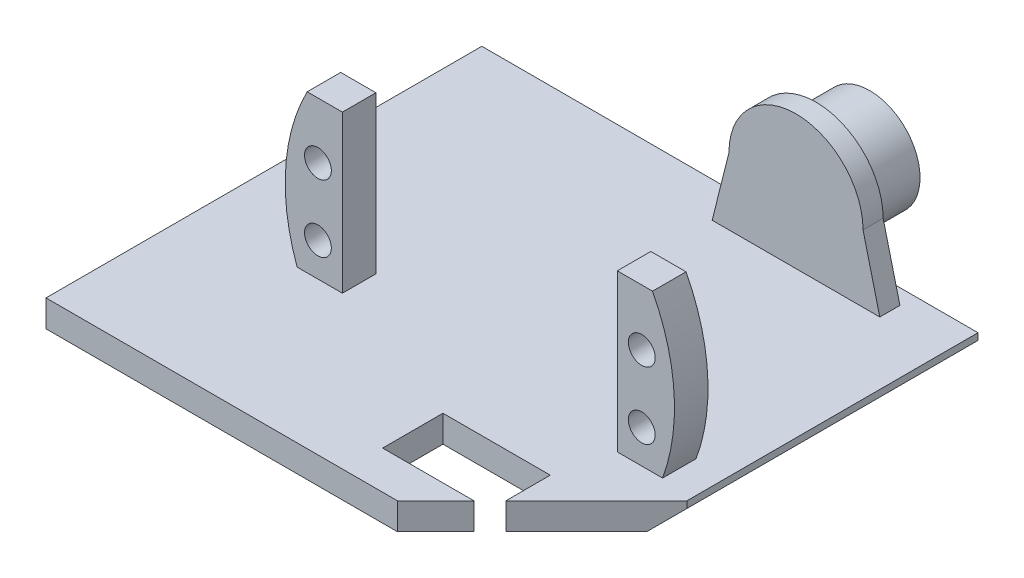
ISO-10303-21;
HEADER;
FILE_DESCRIPTION(('STEP AP214'),'2;1');
FILE_NAME('part.step','',(''),(''),'','','');
FILE_SCHEMA(('AUTOMOTIVE_DESIGN { 1 0 10303 214 1 1 1 1 }'));
ENDSEC;
DATA;
#1=APPLICATION_CONTEXT('core data for automotive mechanical design processes');
#2=APPLICATION_PROTOCOL_DEFINITION('international standard','automotive_design',2000,#1);
#3=PRODUCT_CONTEXT('',#1,'mechanical');
#4=PRODUCT('Part','Part','',(#3));
#5=PRODUCT_RELATED_PRODUCT_CATEGORY('part','',(#4));
#6=PRODUCT_DEFINITION_FORMATION('','',#4);
#7=PRODUCT_DEFINITION_CONTEXT('part definition',#1,'design');
#8=PRODUCT_DEFINITION('design','',#6,#7);
#9=PRODUCT_DEFINITION_SHAPE('','',#8);
#10=(LENGTH_UNIT() NAMED_UNIT(*) SI_UNIT(.MILLI.,.METRE.));
#11=(NAMED_UNIT(*) PLANE_ANGLE_UNIT() SI_UNIT($,.RADIAN.));
#12=(NAMED_UNIT(*) SI_UNIT($,.STERADIAN.) SOLID_ANGLE_UNIT());
#13=UNCERTAINTY_MEASURE_WITH_UNIT(LENGTH_MEASURE(1.E-05),#10,'distance_accuracy_value','');
#14=(GEOMETRIC_REPRESENTATION_CONTEXT(3) GLOBAL_UNCERTAINTY_ASSIGNED_CONTEXT((#13)) GLOBAL_UNIT_ASSIGNED_CONTEXT((#10,
#11,#12)) REPRESENTATION_CONTEXT('',''));
#15=CARTESIAN_POINT('',(0.,0.,0.));
#16=DIRECTION('',(0.,0.,1.));
#17=DIRECTION('',(1.,0.,0.));
#18=AXIS2_PLACEMENT_3D('',#15,#16,#17);
#19=CARTESIAN_POINT('',(12.3318876622746,4.,35.2047449526768));
#20=DIRECTION('',(-0.707106781186544,0.,-0.707106781186551));
#21=DIRECTION('',(-0.707106781186551,0.,0.707106781186544));
#22=AXIS2_PLACEMENT_3D('',#19,#20,#21);
#23=PLANE('',#22);
#24=DIRECTION('',(0.707106781186551,0.,-0.707106781186544));
#25=VECTOR('',#24,1.);
#26=CARTESIAN_POINT('',(12.3318876622746,0.,35.2047449526768));
#27=LINE('',#26,#25);
#28=CARTESIAN_POINT('',(20.4207519000294,0.,27.1158807149221));
#29=VERTEX_POINT('',#28);
#30=CARTESIAN_POINT('',(30.9207519000294,0.,16.6158807149222));
#31=VERTEX_POINT('',#30);
#32=EDGE_CURVE('E214',#29,#31,#27,.T.);
#33=ORIENTED_EDGE('',*,*,#32,.T.);
#34=DIRECTION('',(0.577350269189629,0.577350269189626,-0.577350269189623));
#35=VECTOR('',#34,1.);
#36=CARTESIAN_POINT('',(48.3911304874445,17.470378587415,-0.85449787249274));
#37=LINE('',#36,#35);
#38=CARTESIAN_POINT('',(33.9207519000294,2.99999999999999,13.6158807149222));
#39=VERTEX_POINT('',#38);
#40=EDGE_CURVE('E11',#31,#39,#37,.T.);
#41=ORIENTED_EDGE('',*,*,#40,.T.);
#42=DIRECTION('',(0.,-1.,0.));
#43=VECTOR('',#42,1.);
#44=CARTESIAN_POINT('',(33.9207519000294,4.,13.6158807149222));
#45=LINE('',#44,#43);
#46=CARTESIAN_POINT('',(33.9207519000294,4.,13.6158807149222));
#47=VERTEX_POINT('',#46);
#48=EDGE_CURVE('E228',#47,#39,#45,.T.);
#49=ORIENTED_EDGE('',*,*,#48,.F.);
#50=DIRECTION('',(0.707106781186551,0.,-0.707106781186544));
#51=VECTOR('',#50,1.);
#52=CARTESIAN_POINT('',(12.3318876622746,4.,35.2047449526768));
#53=LINE('',#52,#51);
#54=CARTESIAN_POINT('',(20.4207519000294,4.,27.1158807149221));
#55=VERTEX_POINT('',#54);
#56=EDGE_CURVE('E280',#55,#47,#53,.T.);
#57=ORIENTED_EDGE('',*,*,#56,.F.);
#58=DIRECTION('',(0.,1.,0.));
#59=VECTOR('',#58,1.);
#60=CARTESIAN_POINT('',(20.4207519000294,-0.00100000000000013,27.1158807149221));
#61=LINE('',#60,#59);
#62=EDGE_CURVE('E197',#29,#55,#61,.T.);
#63=ORIENTED_EDGE('',*,*,#62,.F.);
#64=EDGE_LOOP('',(#33,#41,#49,#57,#63));
#65=FACE_BOUND('',#64,.T.);
#66=ADVANCED_FACE('F33',(#65),#23,.F.);
#67=CARTESIAN_POINT('',(24.5707519000294,24.,-24.5));
#68=DIRECTION('',(0.,0.,-1.));
#69=DIRECTION('',(-1.,0.,0.));
#70=AXIS2_PLACEMENT_3D('',#67,#68,#69);
#71=PLANE('',#70);
#72=CARTESIAN_POINT('',(12.0707519000294,14.,-24.5));
#73=DIRECTION('',(0.,0.,-1.));
#74=DIRECTION('',(-1.,0.,0.));
#75=AXIS2_PLACEMENT_3D('',#72,#73,#74);
#76=CIRCLE('',#75,10.);
#77=CARTESIAN_POINT('',(2.07075190002943,14.,-24.5));
#78=VERTEX_POINT('',#77);
#79=CARTESIAN_POINT('',(22.0707519000294,14.,-24.5));
#80=VERTEX_POINT('',#79);
#81=EDGE_CURVE('E662',#78,#80,#76,.T.);
#82=ORIENTED_EDGE('',*,*,#81,.F.);
#83=DIRECTION('',(0.242535625036333,0.970142500145332,0.));
#84=VECTOR('',#83,1.);
#85=CARTESIAN_POINT('',(-1.34517468232525,0.336293670581312,-24.5));
#86=LINE('',#85,#84);
#87=CARTESIAN_POINT('',(-0.429248099970577,4.,-24.5));
#88=VERTEX_POINT('',#87);
#89=EDGE_CURVE('E656',#88,#78,#86,.T.);
#90=ORIENTED_EDGE('',*,*,#89,.F.);
#91=DIRECTION('',(1.,0.,0.));
#92=VECTOR('',#91,1.);
#93=CARTESIAN_POINT('',(24.5707519000294,4.,-24.5));
#94=LINE('',#93,#92);
#95=CARTESIAN_POINT('',(24.5707519000294,4.,-24.5));
#96=VERTEX_POINT('',#95);
#97=EDGE_CURVE('E673',#88,#96,#94,.T.);
#98=ORIENTED_EDGE('',*,*,#97,.T.);
#99=DIRECTION('',(0.242535625036333,-0.970142500145332,0.));
#100=VECTOR('',#99,1.);
#101=CARTESIAN_POINT('',(24.0665900235571,6.01664750588927,-24.5));
#102=LINE('',#101,#100);
#103=EDGE_CURVE('E660',#80,#96,#102,.T.);
#104=ORIENTED_EDGE('',*,*,#103,.F.);
#105=EDGE_LOOP('',(#82,#90,#98,#104));
#106=FACE_BOUND('',#105,.T.);
#107=ADVANCED_FACE('F299',(#106),#71,.F.);
#108=CARTESIAN_POINT('',(-0.429248099970577,24.,-27.5));
#109=DIRECTION('',(0.,0.,1.));
#110=DIRECTION('',(1.,0.,0.));
#111=AXIS2_PLACEMENT_3D('',#108,#109,#110);
#112=PLANE('',#111);
#113=CARTESIAN_POINT('',(12.0707519000294,14.,-27.5));
#114=DIRECTION('',(0.,0.,1.));
#115=DIRECTION('',(1.,0.,0.));
#116=AXIS2_PLACEMENT_3D('',#113,#114,#115);
#117=CIRCLE('',#116,7.5);
#118=CARTESIAN_POINT('',(19.5707519000294,14.,-27.5));
#119=VERTEX_POINT('',#118);
#120=EDGE_CURVE('E235',#119,#119,#117,.F.);
#121=ORIENTED_EDGE('',*,*,#120,.F.);
#122=EDGE_LOOP('',(#121));
#123=FACE_BOUND('',#122,.T.);
#124=DIRECTION('',(-1.,0.,0.));
#125=VECTOR('',#124,1.);
#126=CARTESIAN_POINT('',(-0.429248099970577,4.,-27.5));
#127=LINE('',#126,#125);
#128=CARTESIAN_POINT('',(24.5707519000294,4.,-27.5));
#129=VERTEX_POINT('',#128);
#130=CARTESIAN_POINT('',(-0.429248099970577,4.,-27.5));
#131=VERTEX_POINT('',#130);
#132=EDGE_CURVE('E678',#129,#131,#127,.T.);
#133=ORIENTED_EDGE('',*,*,#132,.T.);
#134=DIRECTION('',(-0.242535625036333,-0.970142500145332,0.));
#135=VECTOR('',#134,1.);
#136=CARTESIAN_POINT('',(-1.34517468232525,0.336293670581312,-27.5));
#137=LINE('',#136,#135);
#138=CARTESIAN_POINT('',(2.07075190002943,14.,-27.5));
#139=VERTEX_POINT('',#138);
#140=EDGE_CURVE('E654',#139,#131,#137,.T.);
#141=ORIENTED_EDGE('',*,*,#140,.F.);
#142=CARTESIAN_POINT('',(12.0707519000294,14.,-27.5));
#143=DIRECTION('',(0.,0.,-1.));
#144=DIRECTION('',(-1.,0.,0.));
#145=AXIS2_PLACEMENT_3D('',#142,#143,#144);
#146=CIRCLE('',#145,10.);
#147=CARTESIAN_POINT('',(22.0707519000294,14.,-27.5));
#148=VERTEX_POINT('',#147);
#149=EDGE_CURVE('E666',#148,#139,#146,.F.);
#150=ORIENTED_EDGE('',*,*,#149,.F.);
#151=DIRECTION('',(-0.242535625036333,0.970142500145332,0.));
#152=VECTOR('',#151,1.);
#153=CARTESIAN_POINT('',(24.0665900235571,6.01664750588927,-27.5));
#154=LINE('',#153,#152);
#155=EDGE_CURVE('E659',#129,#148,#154,.T.);
#156=ORIENTED_EDGE('',*,*,#155,.F.);
#157=EDGE_LOOP('',(#133,#141,#150,#156));
#158=FACE_BOUND('',#157,.T.);
#159=ADVANCED_FACE('F304',(#123,#158),#112,.F.);
#160=CARTESIAN_POINT('',(0.,4.,0.));
#161=DIRECTION('',(0.,-1.,0.));
#162=DIRECTION('',(0.,0.,-1.));
#163=AXIS2_PLACEMENT_3D('',#160,#161,#162);
#164=PLANE('',#163);
#165=DIRECTION('',(0.,0.,-1.));
#166=VECTOR('',#165,1.);
#167=CARTESIAN_POINT('',(29.1707519000294,4.,7.50000000000001));
#168=LINE('',#167,#166);
#169=CARTESIAN_POINT('',(29.1707519000294,4.,12.5));
#170=VERTEX_POINT('',#169);
#171=CARTESIAN_POINT('',(29.1707519000294,4.,7.50000000000001));
#172=VERTEX_POINT('',#171);
#173=EDGE_CURVE('E738',#170,#172,#168,.T.);
#174=ORIENTED_EDGE('',*,*,#173,.F.);
#175=DIRECTION('',(1.,0.,0.));
#176=VECTOR('',#175,1.);
#177=CARTESIAN_POINT('',(29.1707519000294,4.,12.5));
#178=LINE('',#177,#176);
#179=CARTESIAN_POINT('',(22.4207519000294,4.,12.5));
#180=VERTEX_POINT('',#179);
#181=EDGE_CURVE('E747',#180,#170,#178,.T.);
#182=ORIENTED_EDGE('',*,*,#181,.F.);
#183=DIRECTION('',(0.,0.,1.));
#184=VECTOR('',#183,1.);
#185=CARTESIAN_POINT('',(22.4207519000294,4.,7.50000000000001));
#186=LINE('',#185,#184);
#187=CARTESIAN_POINT('',(22.4207519000294,4.,7.50000000000001));
#188=VERTEX_POINT('',#187);
#189=EDGE_CURVE('E744',#188,#180,#186,.T.);
#190=ORIENTED_EDGE('',*,*,#189,.F.);
#191=DIRECTION('',(-1.,0.,0.));
#192=VECTOR('',#191,1.);
#193=CARTESIAN_POINT('',(29.1707519000294,4.,7.50000000000001));
#194=LINE('',#193,#192);
#195=EDGE_CURVE('E741',#172,#188,#194,.T.);
#196=ORIENTED_EDGE('',*,*,#195,.F.);
#197=EDGE_LOOP('',(#174,#182,#190,#196));
#198=FACE_BOUND('',#197,.T.);
#199=DIRECTION('',(-1.,0.,0.));
#200=VECTOR('',#199,1.);
#201=CARTESIAN_POINT('',(20.4207519000294,4.,20.5));
#202=LINE('',#201,#200);
#203=CARTESIAN_POINT('',(20.4207519000294,4.,20.5));
#204=VERTEX_POINT('',#203);
#205=CARTESIAN_POINT('',(4.42075190002941,4.,20.5));
#206=VERTEX_POINT('',#205);
#207=EDGE_CURVE('E637',#204,#206,#202,.T.);
#208=ORIENTED_EDGE('',*,*,#207,.F.);
#209=DIRECTION('',(0.,0.,-1.));
#210=VECTOR('',#209,1.);
#211=CARTESIAN_POINT('',(20.4207519000294,4.,20.5));
#212=LINE('',#211,#210);
#213=EDGE_CURVE('E287',#55,#204,#212,.T.);
#214=ORIENTED_EDGE('',*,*,#213,.F.);
#215=ORIENTED_EDGE('',*,*,#56,.T.);
#216=DIRECTION('',(0.,0.,-1.));
#217=VECTOR('',#216,1.);
#218=CARTESIAN_POINT('',(33.9207519000294,4.,-29.7952550473232));
#219=LINE('',#218,#217);
#220=CARTESIAN_POINT('',(33.9207519000294,4.,-29.7952550473232));
#221=VERTEX_POINT('',#220);
#222=EDGE_CURVE('E255',#47,#221,#219,.T.);
#223=ORIENTED_EDGE('',*,*,#222,.T.);
#224=DIRECTION('',(-1.,0.,0.));
#225=VECTOR('',#224,1.);
#226=CARTESIAN_POINT('',(33.9207519000294,4.,-29.7952550473232));
#227=LINE('',#226,#225);
#228=CARTESIAN_POINT('',(-40.0792480999706,4.,-29.7952550473231));
#229=VERTEX_POINT('',#228);
#230=EDGE_CURVE('E226',#221,#229,#227,.T.);
#231=ORIENTED_EDGE('',*,*,#230,.T.);
#232=DIRECTION('',(0.,0.,1.));
#233=VECTOR('',#232,1.);
#234=CARTESIAN_POINT('',(-40.0792480999706,4.,-29.7952550473231));
#235=LINE('',#234,#233);
#236=CARTESIAN_POINT('',(-40.0792480999706,4.,35.2047449526769));
#237=VERTEX_POINT('',#236);
#238=EDGE_CURVE('E216',#229,#237,#235,.T.);
#239=ORIENTED_EDGE('',*,*,#238,.T.);
#240=DIRECTION('',(1.,0.,0.));
#241=VECTOR('',#240,1.);
#242=CARTESIAN_POINT('',(12.3318876622746,4.,35.2047449526768));
#243=LINE('',#242,#241);
#244=CARTESIAN_POINT('',(12.3318876622746,4.,35.2047449526768));
#245=VERTEX_POINT('',#244);
#246=EDGE_CURVE('E279',#237,#245,#243,.T.);
#247=ORIENTED_EDGE('',*,*,#246,.T.);
#248=CARTESIAN_POINT('',(18.0366326149515,4.,29.5));
#249=VERTEX_POINT('',#248);
#250=EDGE_CURVE('E257',#245,#249,#53,.T.);
#251=ORIENTED_EDGE('',*,*,#250,.T.);
#252=DIRECTION('',(1.,0.,0.));
#253=VECTOR('',#252,1.);
#254=CARTESIAN_POINT('',(20.4207519000294,4.,29.5));
#255=LINE('',#254,#253);
#256=CARTESIAN_POINT('',(4.42075190002941,4.,29.5));
#257=VERTEX_POINT('',#256);
#258=EDGE_CURVE('E192',#257,#249,#255,.T.);
#259=ORIENTED_EDGE('',*,*,#258,.F.);
#260=DIRECTION('',(0.,0.,1.));
#261=VECTOR('',#260,1.);
#262=CARTESIAN_POINT('',(4.42075190002941,4.,20.5));
#263=LINE('',#262,#261);
#264=EDGE_CURVE('E634',#206,#257,#263,.T.);
#265=ORIENTED_EDGE('',*,*,#264,.F.);
#266=EDGE_LOOP('',(#208,#214,#215,#223,#231,#239,#247,#251,#259,#265));
#267=FACE_BOUND('',#266,.T.);
#268=DIRECTION('',(0.,0.,-1.));
#269=VECTOR('',#268,1.);
#270=CARTESIAN_POINT('',(-18.5792480999706,4.,7.50000000000001));
#271=LINE('',#270,#269);
#272=CARTESIAN_POINT('',(-18.5792480999706,4.,12.5));
#273=VERTEX_POINT('',#272);
#274=CARTESIAN_POINT('',(-18.5792480999706,4.,7.50000000000001));
#275=VERTEX_POINT('',#274);
#276=EDGE_CURVE('E756',#273,#275,#271,.T.);
#277=ORIENTED_EDGE('',*,*,#276,.F.);
#278=DIRECTION('',(1.,0.,0.));
#279=VECTOR('',#278,1.);
#280=CARTESIAN_POINT('',(-25.3292480999706,4.,12.5));
#281=LINE('',#280,#279);
#282=CARTESIAN_POINT('',(-25.3292480999706,4.,12.5));
#283=VERTEX_POINT('',#282);
#284=EDGE_CURVE('E274',#283,#273,#281,.T.);
#285=ORIENTED_EDGE('',*,*,#284,.F.);
#286=DIRECTION('',(0.,0.,1.));
#287=VECTOR('',#286,1.);
#288=CARTESIAN_POINT('',(-25.3292480999706,4.,7.50000000000001));
#289=LINE('',#288,#287);
#290=CARTESIAN_POINT('',(-25.3292480999706,4.,7.50000000000001));
#291=VERTEX_POINT('',#290);
#292=EDGE_CURVE('E760',#291,#283,#289,.T.);
#293=ORIENTED_EDGE('',*,*,#292,.F.);
#294=DIRECTION('',(-1.,0.,0.));
#295=VECTOR('',#294,1.);
#296=CARTESIAN_POINT('',(-25.3292480999706,4.,7.50000000000001));
#297=LINE('',#296,#295);
#298=EDGE_CURVE('E758',#275,#291,#297,.T.);
#299=ORIENTED_EDGE('',*,*,#298,.F.);
#300=EDGE_LOOP('',(#277,#285,#293,#299));
#301=FACE_BOUND('',#300,.T.);
#302=ORIENTED_EDGE('',*,*,#97,.F.);
#303=DIRECTION('',(0.,0.,1.));
#304=VECTOR('',#303,1.);
#305=CARTESIAN_POINT('',(-0.429248099970577,4.,-24.5));
#306=LINE('',#305,#304);
#307=EDGE_CURVE('E681',#131,#88,#306,.T.);
#308=ORIENTED_EDGE('',*,*,#307,.F.);
#309=ORIENTED_EDGE('',*,*,#132,.F.);
#310=DIRECTION('',(0.,0.,-1.));
#311=VECTOR('',#310,1.);
#312=CARTESIAN_POINT('',(24.5707519000294,4.,-27.5));
#313=LINE('',#312,#311);
#314=EDGE_CURVE('E676',#96,#129,#313,.T.);
#315=ORIENTED_EDGE('',*,*,#314,.F.);
#316=EDGE_LOOP('',(#302,#308,#309,#315));
#317=FACE_BOUND('',#316,.T.);
#318=ADVANCED_FACE('F284',(#198,#267,#301,#317),#164,.F.);
#319=CARTESIAN_POINT('',(-40.0792480999706,4.,-29.7952550473231));
#320=DIRECTION('',(1.,0.,0.));
#321=DIRECTION('',(0.,0.,-1.));
#322=AXIS2_PLACEMENT_3D('',#319,#320,#321);
#323=PLANE('',#322);
#324=DIRECTION('',(0.,0.,1.));
#325=VECTOR('',#324,1.);
#326=CARTESIAN_POINT('',(-40.0792480999706,0.,-29.7952550473231));
#327=LINE('',#326,#325);
#328=CARTESIAN_POINT('',(-40.0792480999706,0.,-29.7952550473231));
#329=VERTEX_POINT('',#328);
#330=CARTESIAN_POINT('',(-40.0792480999706,0.,35.2047449526769));
#331=VERTEX_POINT('',#330);
#332=EDGE_CURVE('E260',#329,#331,#327,.T.);
#333=ORIENTED_EDGE('',*,*,#332,.T.);
#334=DIRECTION('',(0.,-1.,0.));
#335=VECTOR('',#334,1.);
#336=CARTESIAN_POINT('',(-40.0792480999706,4.,35.2047449526769));
#337=LINE('',#336,#335);
#338=EDGE_CURVE('E232',#237,#331,#337,.T.);
#339=ORIENTED_EDGE('',*,*,#338,.F.);
#340=ORIENTED_EDGE('',*,*,#238,.F.);
#341=DIRECTION('',(0.,-1.,0.));
#342=VECTOR('',#341,1.);
#343=CARTESIAN_POINT('',(-40.0792480999706,4.,-29.7952550473231));
#344=LINE('',#343,#342);
#345=EDGE_CURVE('E222',#229,#329,#344,.T.);
#346=ORIENTED_EDGE('',*,*,#345,.T.);
#347=EDGE_LOOP('',(#333,#339,#340,#346));
#348=FACE_BOUND('',#347,.T.);
#349=ADVANCED_FACE('F315',(#348),#323,.F.);
#350=CARTESIAN_POINT('',(12.3318876622746,4.,35.2047449526768));
#351=DIRECTION('',(0.,0.,-1.));
#352=DIRECTION('',(-1.,0.,0.));
#353=AXIS2_PLACEMENT_3D('',#350,#351,#352);
#354=PLANE('',#353);
#355=DIRECTION('',(1.,0.,0.));
#356=VECTOR('',#355,1.);
#357=CARTESIAN_POINT('',(12.3318876622746,0.,35.2047449526768));
#358=LINE('',#357,#356);
#359=CARTESIAN_POINT('',(12.3318876622746,0.,35.2047449526768));
#360=VERTEX_POINT('',#359);
#361=EDGE_CURVE('E218',#331,#360,#358,.T.);
#362=ORIENTED_EDGE('',*,*,#361,.T.);
#363=DIRECTION('',(0.,-1.,0.));
#364=VECTOR('',#363,1.);
#365=CARTESIAN_POINT('',(12.3318876622746,4.,35.2047449526768));
#366=LINE('',#365,#364);
#367=EDGE_CURVE('E212',#245,#360,#366,.T.);
#368=ORIENTED_EDGE('',*,*,#367,.F.);
#369=ORIENTED_EDGE('',*,*,#246,.F.);
#370=ORIENTED_EDGE('',*,*,#338,.T.);
#371=EDGE_LOOP('',(#362,#368,#369,#370));
#372=FACE_BOUND('',#371,.T.);
#373=ADVANCED_FACE('F310',(#372),#354,.F.);
#374=CARTESIAN_POINT('',(18.0366326149515,0.,29.5));
#375=VERTEX_POINT('',#374);
#376=EDGE_CURVE('E202',#360,#375,#27,.T.);
#377=ORIENTED_EDGE('',*,*,#376,.T.);
#378=DIRECTION('',(0.,-1.,0.));
#379=VECTOR('',#378,1.);
#380=CARTESIAN_POINT('',(18.0366326149515,-0.00100000000000013,29.5));
#381=LINE('',#380,#379);
#382=EDGE_CURVE('E186',#249,#375,#381,.T.);
#383=ORIENTED_EDGE('',*,*,#382,.F.);
#384=ORIENTED_EDGE('',*,*,#250,.F.);
#385=ORIENTED_EDGE('',*,*,#367,.T.);
#386=EDGE_LOOP('',(#377,#383,#384,#385));
#387=FACE_BOUND('',#386,.T.);
#388=ADVANCED_FACE('F210',(#387),#23,.F.);
#389=CARTESIAN_POINT('',(33.9207519000294,4.,-29.7952550473232));
#390=DIRECTION('',(-1.,0.,0.));
#391=DIRECTION('',(0.,0.,1.));
#392=AXIS2_PLACEMENT_3D('',#389,#390,#391);
#393=PLANE('',#392);
#394=ORIENTED_EDGE('',*,*,#48,.T.);
#395=DIRECTION('',(0.,0.,-1.));
#396=VECTOR('',#395,1.);
#397=CARTESIAN_POINT('',(33.9207519000294,2.99999999999999,-29.7952550473232));
#398=LINE('',#397,#396);
#399=CARTESIAN_POINT('',(33.9207519000294,2.99999999999999,-29.7952550473232));
#400=VERTEX_POINT('',#399);
#401=EDGE_CURVE('E238',#39,#400,#398,.T.);
#402=ORIENTED_EDGE('',*,*,#401,.T.);
#403=DIRECTION('',(0.,-1.,0.));
#404=VECTOR('',#403,1.);
#405=CARTESIAN_POINT('',(33.9207519000294,4.,-29.7952550473232));
#406=LINE('',#405,#404);
#407=EDGE_CURVE('E225',#221,#400,#406,.T.);
#408=ORIENTED_EDGE('',*,*,#407,.F.);
#409=ORIENTED_EDGE('',*,*,#222,.F.);
#410=EDGE_LOOP('',(#394,#402,#408,#409));
#411=FACE_BOUND('',#410,.T.);
#412=ADVANCED_FACE('F244',(#411),#393,.F.);
#413=CARTESIAN_POINT('',(33.9207519000294,4.,-29.7952550473232));
#414=DIRECTION('',(0.,0.,1.));
#415=DIRECTION('',(1.,0.,0.));
#416=AXIS2_PLACEMENT_3D('',#413,#414,#415);
#417=PLANE('',#416);
#418=ORIENTED_EDGE('',*,*,#407,.T.);
#419=DIRECTION('',(-0.707106781186549,-0.707106781186546,0.));
#420=VECTOR('',#419,1.);
#421=CARTESIAN_POINT('',(33.9207519000294,2.99999999999999,-29.7952550473232));
#422=LINE('',#421,#420);
#423=CARTESIAN_POINT('',(30.9207519000294,0.,-29.7952550473232));
#424=VERTEX_POINT('',#423);
#425=EDGE_CURVE('E55',#400,#424,#422,.T.);
#426=ORIENTED_EDGE('',*,*,#425,.T.);
#427=DIRECTION('',(-1.,0.,0.));
#428=VECTOR('',#427,1.);
#429=CARTESIAN_POINT('',(33.9207519000294,0.,-29.7952550473232));
#430=LINE('',#429,#428);
#431=EDGE_CURVE('E213',#424,#329,#430,.T.);
#432=ORIENTED_EDGE('',*,*,#431,.T.);
#433=ORIENTED_EDGE('',*,*,#345,.F.);
#434=ORIENTED_EDGE('',*,*,#230,.F.);
#435=EDGE_LOOP('',(#418,#426,#432,#433,#434));
#436=FACE_BOUND('',#435,.T.);
#437=ADVANCED_FACE('F250',(#436),#417,.F.);
#438=CARTESIAN_POINT('',(0.,0.,0.));
#439=DIRECTION('',(0.,-1.,0.));
#440=DIRECTION('',(0.,0.,-1.));
#441=AXIS2_PLACEMENT_3D('',#438,#439,#440);
#442=PLANE('',#441);
#443=ORIENTED_EDGE('',*,*,#431,.F.);
#444=DIRECTION('',(0.,0.,1.));
#445=VECTOR('',#444,1.);
#446=CARTESIAN_POINT('',(30.9207519000294,0.,13.6158807149222));
#447=LINE('',#446,#445);
#448=EDGE_CURVE('E41',#424,#31,#447,.T.);
#449=ORIENTED_EDGE('',*,*,#448,.T.);
#450=ORIENTED_EDGE('',*,*,#32,.F.);
#451=DIRECTION('',(0.,0.,-1.));
#452=VECTOR('',#451,1.);
#453=CARTESIAN_POINT('',(20.4207519000294,0.,20.5));
#454=LINE('',#453,#452);
#455=CARTESIAN_POINT('',(20.4207519000294,0.,20.5));
#456=VERTEX_POINT('',#455);
#457=EDGE_CURVE('E641',#29,#456,#454,.T.);
#458=ORIENTED_EDGE('',*,*,#457,.T.);
#459=DIRECTION('',(-1.,0.,0.));
#460=VECTOR('',#459,1.);
#461=CARTESIAN_POINT('',(20.4207519000294,0.,20.5));
#462=LINE('',#461,#460);
#463=CARTESIAN_POINT('',(4.42075190002941,0.,20.5));
#464=VERTEX_POINT('',#463);
#465=EDGE_CURVE('E645',#456,#464,#462,.T.);
#466=ORIENTED_EDGE('',*,*,#465,.T.);
#467=DIRECTION('',(0.,0.,1.));
#468=VECTOR('',#467,1.);
#469=CARTESIAN_POINT('',(4.42075190002941,0.,20.5));
#470=LINE('',#469,#468);
#471=CARTESIAN_POINT('',(4.42075190002941,0.,29.5));
#472=VERTEX_POINT('',#471);
#473=EDGE_CURVE('E205',#464,#472,#470,.T.);
#474=ORIENTED_EDGE('',*,*,#473,.T.);
#475=DIRECTION('',(1.,0.,0.));
#476=VECTOR('',#475,1.);
#477=CARTESIAN_POINT('',(20.4207519000294,0.,29.5));
#478=LINE('',#477,#476);
#479=EDGE_CURVE('E189',#472,#375,#478,.T.);
#480=ORIENTED_EDGE('',*,*,#479,.T.);
#481=ORIENTED_EDGE('',*,*,#376,.F.);
#482=ORIENTED_EDGE('',*,*,#361,.F.);
#483=ORIENTED_EDGE('',*,*,#332,.F.);
#484=EDGE_LOOP('',(#443,#449,#450,#458,#466,#474,#480,#481,#482,#483));
#485=FACE_BOUND('',#484,.T.);
#486=ADVANCED_FACE('F201',(#485),#442,.T.);
#487=CARTESIAN_POINT('',(-18.5792480999706,22.,7.50000000000001));
#488=DIRECTION('',(-1.,0.,0.));
#489=DIRECTION('',(0.,0.,1.));
#490=AXIS2_PLACEMENT_3D('',#487,#488,#489);
#491=PLANE('',#490);
#492=ORIENTED_EDGE('',*,*,#276,.T.);
#493=DIRECTION('',(0.,-1.,0.));
#494=VECTOR('',#493,1.);
#495=CARTESIAN_POINT('',(-18.5792480999706,22.,7.50000000000001));
#496=LINE('',#495,#494);
#497=CARTESIAN_POINT('',(-18.5792480999706,27.3934431027405,7.50000000000001));
#498=VERTEX_POINT('',#497);
#499=EDGE_CURVE('E262',#498,#275,#496,.T.);
#500=ORIENTED_EDGE('',*,*,#499,.F.);
#501=DIRECTION('',(0.,0.,1.));
#502=VECTOR('',#501,1.);
#503=CARTESIAN_POINT('',(-18.5792480999706,27.3934431027405,-17.3990294367013));
#504=LINE('',#503,#502);
#505=CARTESIAN_POINT('',(-18.5792480999706,27.3934431027405,12.5));
#506=VERTEX_POINT('',#505);
#507=EDGE_CURVE('E711',#498,#506,#504,.T.);
#508=ORIENTED_EDGE('',*,*,#507,.T.);
#509=DIRECTION('',(0.,-1.,0.));
#510=VECTOR('',#509,1.);
#511=CARTESIAN_POINT('',(-18.5792480999706,22.,12.5));
#512=LINE('',#511,#510);
#513=EDGE_CURVE('E267',#506,#273,#512,.T.);
#514=ORIENTED_EDGE('',*,*,#513,.T.);
#515=EDGE_LOOP('',(#492,#500,#508,#514));
#516=FACE_BOUND('',#515,.T.);
#517=ADVANCED_FACE('F332',(#516),#491,.F.);
#518=CARTESIAN_POINT('',(-25.3292480999706,22.,7.50000000000001));
#519=DIRECTION('',(0.,0.,1.));
#520=DIRECTION('',(1.,0.,0.));
#521=AXIS2_PLACEMENT_3D('',#518,#519,#520);
#522=PLANE('',#521);
#523=ORIENTED_EDGE('',*,*,#298,.T.);
#524=CARTESIAN_POINT('',(1.92075190002942,14.,7.50000000000001));
#525=DIRECTION('',(0.,0.,1.));
#526=DIRECTION('',(1.,0.,0.));
#527=AXIS2_PLACEMENT_3D('',#524,#525,#526);
#528=CIRCLE('',#527,29.0269271539376);
#529=CARTESIAN_POINT('',(-23.8314942515911,27.3934431027405,7.50000000000001));
#530=VERTEX_POINT('',#529);
#531=EDGE_CURVE('E702',#291,#530,#528,.F.);
#532=ORIENTED_EDGE('',*,*,#531,.T.);
#533=DIRECTION('',(1.,0.,0.));
#534=VECTOR('',#533,1.);
#535=CARTESIAN_POINT('',(-18.5792480999706,27.3934431027405,7.50000000000001));
#536=LINE('',#535,#534);
#537=EDGE_CURVE('E700',#530,#498,#536,.T.);
#538=ORIENTED_EDGE('',*,*,#537,.T.);
#539=ORIENTED_EDGE('',*,*,#499,.T.);
#540=EDGE_LOOP('',(#523,#532,#538,#539));
#541=FACE_BOUND('',#540,.T.);
#542=CARTESIAN_POINT('',(-22.2292480999706,19.,7.50000000000001));
#543=DIRECTION('',(0.,0.,1.));
#544=DIRECTION('',(1.,0.,0.));
#545=AXIS2_PLACEMENT_3D('',#542,#543,#544);
#546=CIRCLE('',#545,2.00000000000001);
#547=CARTESIAN_POINT('',(-20.2292480999706,19.,7.50000000000001));
#548=VERTEX_POINT('',#547);
#549=EDGE_CURVE('E729',#548,#548,#546,.T.);
#550=ORIENTED_EDGE('',*,*,#549,.T.);
#551=EDGE_LOOP('',(#550));
#552=FACE_BOUND('',#551,.T.);
#553=CARTESIAN_POINT('',(-22.2292480999706,9.00000000000001,7.50000000000001));
#554=DIRECTION('',(0.,0.,1.));
#555=DIRECTION('',(1.,0.,0.));
#556=AXIS2_PLACEMENT_3D('',#553,#554,#555);
#557=CIRCLE('',#556,2.);
#558=CARTESIAN_POINT('',(-20.2292480999706,9.00000000000001,7.50000000000001));
#559=VERTEX_POINT('',#558);
#560=EDGE_CURVE('E735',#559,#559,#557,.T.);
#561=ORIENTED_EDGE('',*,*,#560,.T.);
#562=EDGE_LOOP('',(#561));
#563=FACE_BOUND('',#562,.T.);
#564=ADVANCED_FACE('F351',(#541,#552,#563),#522,.F.);
#565=CARTESIAN_POINT('',(-25.3292480999706,22.,12.5));
#566=DIRECTION('',(0.,0.,-1.));
#567=DIRECTION('',(-1.,0.,0.));
#568=AXIS2_PLACEMENT_3D('',#565,#566,#567);
#569=PLANE('',#568);
#570=CARTESIAN_POINT('',(1.92075190002942,14.,12.5));
#571=DIRECTION('',(0.,0.,1.));
#572=DIRECTION('',(-1.,0.,0.));
#573=AXIS2_PLACEMENT_3D('',#570,#571,#572);
#574=CIRCLE('',#573,29.0269271539376);
#575=CARTESIAN_POINT('',(-23.8314942515911,27.3934431027405,12.5));
#576=VERTEX_POINT('',#575);
#577=EDGE_CURVE('E699',#576,#283,#574,.T.);
#578=ORIENTED_EDGE('',*,*,#577,.T.);
#579=ORIENTED_EDGE('',*,*,#284,.T.);
#580=ORIENTED_EDGE('',*,*,#513,.F.);
#581=DIRECTION('',(-1.,0.,0.));
#582=VECTOR('',#581,1.);
#583=CARTESIAN_POINT('',(-18.5792480999706,27.3934431027405,12.5));
#584=LINE('',#583,#582);
#585=EDGE_CURVE('E708',#506,#576,#584,.T.);
#586=ORIENTED_EDGE('',*,*,#585,.T.);
#587=EDGE_LOOP('',(#578,#579,#580,#586));
#588=FACE_BOUND('',#587,.T.);
#589=CARTESIAN_POINT('',(-22.2292480999706,19.,12.5));
#590=DIRECTION('',(0.,0.,1.));
#591=DIRECTION('',(1.,0.,0.));
#592=AXIS2_PLACEMENT_3D('',#589,#590,#591);
#593=CIRCLE('',#592,2.00000000000001);
#594=CARTESIAN_POINT('',(-20.2292480999706,19.,12.5));
#595=VERTEX_POINT('',#594);
#596=EDGE_CURVE('E715',#595,#595,#593,.T.);
#597=ORIENTED_EDGE('',*,*,#596,.F.);
#598=EDGE_LOOP('',(#597));
#599=FACE_BOUND('',#598,.T.);
#600=CARTESIAN_POINT('',(-22.2292480999706,9.00000000000001,12.5));
#601=DIRECTION('',(0.,0.,1.));
#602=DIRECTION('',(1.,0.,0.));
#603=AXIS2_PLACEMENT_3D('',#600,#601,#602);
#604=CIRCLE('',#603,2.);
#605=CARTESIAN_POINT('',(-20.2292480999706,9.00000000000001,12.5));
#606=VERTEX_POINT('',#605);
#607=EDGE_CURVE('E732',#606,#606,#604,.T.);
#608=ORIENTED_EDGE('',*,*,#607,.F.);
#609=EDGE_LOOP('',(#608));
#610=FACE_BOUND('',#609,.T.);
#611=ADVANCED_FACE('F359',(#588,#599,#610),#569,.F.);
#612=CARTESIAN_POINT('',(29.1707519000294,22.,7.50000000000001));
#613=DIRECTION('',(0.,0.,1.));
#614=DIRECTION('',(1.,0.,0.));
#615=AXIS2_PLACEMENT_3D('',#612,#613,#614);
#616=PLANE('',#615);
#617=CARTESIAN_POINT('',(1.92075190002942,14.,7.50000000000001));
#618=DIRECTION('',(0.,0.,1.));
#619=DIRECTION('',(1.,0.,0.));
#620=AXIS2_PLACEMENT_3D('',#617,#618,#619);
#621=CIRCLE('',#620,29.0269271539376);
#622=CARTESIAN_POINT('',(27.6729980516499,27.3934431027405,7.5));
#623=VERTEX_POINT('',#622);
#624=EDGE_CURVE('E684',#623,#172,#621,.F.);
#625=ORIENTED_EDGE('',*,*,#624,.T.);
#626=ORIENTED_EDGE('',*,*,#195,.T.);
#627=DIRECTION('',(0.,-1.,0.));
#628=VECTOR('',#627,1.);
#629=CARTESIAN_POINT('',(22.4207519000294,22.,7.50000000000001));
#630=LINE('',#629,#628);
#631=CARTESIAN_POINT('',(22.4207519000294,27.3934431027405,7.5));
#632=VERTEX_POINT('',#631);
#633=EDGE_CURVE('E753',#632,#188,#630,.T.);
#634=ORIENTED_EDGE('',*,*,#633,.F.);
#635=DIRECTION('',(1.,0.,0.));
#636=VECTOR('',#635,1.);
#637=CARTESIAN_POINT('',(22.4207519000294,27.3934431027405,7.5));
#638=LINE('',#637,#636);
#639=EDGE_CURVE('E687',#632,#623,#638,.T.);
#640=ORIENTED_EDGE('',*,*,#639,.T.);
#641=EDGE_LOOP('',(#625,#626,#634,#640));
#642=FACE_BOUND('',#641,.T.);
#643=CARTESIAN_POINT('',(26.0707519000294,19.,7.50000000000001));
#644=DIRECTION('',(0.,0.,1.));
#645=DIRECTION('',(1.,0.,0.));
#646=AXIS2_PLACEMENT_3D('',#643,#644,#645);
#647=CIRCLE('',#646,2.00000000000001);
#648=CARTESIAN_POINT('',(28.0707519000294,19.,7.50000000000001));
#649=VERTEX_POINT('',#648);
#650=EDGE_CURVE('E726',#649,#649,#647,.T.);
#651=ORIENTED_EDGE('',*,*,#650,.T.);
#652=EDGE_LOOP('',(#651));
#653=FACE_BOUND('',#652,.T.);
#654=CARTESIAN_POINT('',(26.0707519000294,9.00000000000001,7.50000000000001));
#655=DIRECTION('',(0.,0.,1.));
#656=DIRECTION('',(1.,0.,0.));
#657=AXIS2_PLACEMENT_3D('',#654,#655,#656);
#658=CIRCLE('',#657,2.);
#659=CARTESIAN_POINT('',(28.0707519000294,9.00000000000001,7.50000000000001));
#660=VERTEX_POINT('',#659);
#661=EDGE_CURVE('E718',#660,#660,#658,.T.);
#662=ORIENTED_EDGE('',*,*,#661,.T.);
#663=EDGE_LOOP('',(#662));
#664=FACE_BOUND('',#663,.T.);
#665=ADVANCED_FACE('F365',(#642,#653,#664),#616,.F.);
#666=CARTESIAN_POINT('',(22.4207519000294,22.,7.50000000000001));
#667=DIRECTION('',(1.,0.,0.));
#668=DIRECTION('',(0.,0.,-1.));
#669=AXIS2_PLACEMENT_3D('',#666,#667,#668);
#670=PLANE('',#669);
#671=ORIENTED_EDGE('',*,*,#189,.T.);
#672=DIRECTION('',(0.,-1.,0.));
#673=VECTOR('',#672,1.);
#674=CARTESIAN_POINT('',(22.4207519000294,22.,12.5));
#675=LINE('',#674,#673);
#676=CARTESIAN_POINT('',(22.4207519000294,27.3934431027405,12.5));
#677=VERTEX_POINT('',#676);
#678=EDGE_CURVE('E750',#677,#180,#675,.T.);
#679=ORIENTED_EDGE('',*,*,#678,.F.);
#680=DIRECTION('',(0.,0.,1.));
#681=VECTOR('',#680,1.);
#682=CARTESIAN_POINT('',(22.4207519000294,27.3934431027405,-17.3990294367013));
#683=LINE('',#682,#681);
#684=EDGE_CURVE('E688',#632,#677,#683,.T.);
#685=ORIENTED_EDGE('',*,*,#684,.F.);
#686=ORIENTED_EDGE('',*,*,#633,.T.);
#687=EDGE_LOOP('',(#671,#679,#685,#686));
#688=FACE_BOUND('',#687,.T.);
#689=ADVANCED_FACE('F373',(#688),#670,.F.);
#690=CARTESIAN_POINT('',(29.1707519000294,22.,12.5));
#691=DIRECTION('',(0.,0.,-1.));
#692=DIRECTION('',(-1.,0.,0.));
#693=AXIS2_PLACEMENT_3D('',#690,#691,#692);
#694=PLANE('',#693);
#695=ORIENTED_EDGE('',*,*,#181,.T.);
#696=CARTESIAN_POINT('',(1.92075190002942,14.,12.5));
#697=DIRECTION('',(0.,0.,1.));
#698=DIRECTION('',(1.,0.,0.));
#699=AXIS2_PLACEMENT_3D('',#696,#697,#698);
#700=CIRCLE('',#699,29.0269271539376);
#701=CARTESIAN_POINT('',(27.6729980516499,27.3934431027405,12.5));
#702=VERTEX_POINT('',#701);
#703=EDGE_CURVE('E683',#170,#702,#700,.T.);
#704=ORIENTED_EDGE('',*,*,#703,.T.);
#705=DIRECTION('',(-1.,0.,0.));
#706=VECTOR('',#705,1.);
#707=CARTESIAN_POINT('',(22.4207519000294,27.3934431027405,12.5));
#708=LINE('',#707,#706);
#709=EDGE_CURVE('E691',#702,#677,#708,.T.);
#710=ORIENTED_EDGE('',*,*,#709,.T.);
#711=ORIENTED_EDGE('',*,*,#678,.T.);
#712=EDGE_LOOP('',(#695,#704,#710,#711));
#713=FACE_BOUND('',#712,.T.);
#714=CARTESIAN_POINT('',(26.0707519000294,19.,12.5));
#715=DIRECTION('',(0.,0.,1.));
#716=DIRECTION('',(-1.,0.,0.));
#717=AXIS2_PLACEMENT_3D('',#714,#715,#716);
#718=CIRCLE('',#717,2.00000000000001);
#719=CARTESIAN_POINT('',(24.0707519000294,19.,12.5));
#720=VERTEX_POINT('',#719);
#721=EDGE_CURVE('E719',#720,#720,#718,.T.);
#722=ORIENTED_EDGE('',*,*,#721,.F.);
#723=EDGE_LOOP('',(#722));
#724=FACE_BOUND('',#723,.T.);
#725=CARTESIAN_POINT('',(26.0707519000294,9.00000000000001,12.5));
#726=DIRECTION('',(0.,0.,1.));
#727=DIRECTION('',(-1.,0.,0.));
#728=AXIS2_PLACEMENT_3D('',#725,#726,#727);
#729=CIRCLE('',#728,2.);
#730=CARTESIAN_POINT('',(24.0707519000294,9.00000000000001,12.5));
#731=VERTEX_POINT('',#730);
#732=EDGE_CURVE('E705',#731,#731,#729,.T.);
#733=ORIENTED_EDGE('',*,*,#732,.F.);
#734=EDGE_LOOP('',(#733));
#735=FACE_BOUND('',#734,.T.);
#736=ADVANCED_FACE('F381',(#713,#724,#735),#694,.F.);
#737=CARTESIAN_POINT('',(-22.2292480999706,9.00000000000001,2.50000000000001));
#738=DIRECTION('',(0.,0.,1.));
#739=DIRECTION('',(1.,0.,0.));
#740=AXIS2_PLACEMENT_3D('',#737,#738,#739);
#741=CYLINDRICAL_SURFACE('',#740,2.);
#742=ORIENTED_EDGE('',*,*,#607,.T.);
#743=EDGE_LOOP('',(#742));
#744=FACE_BOUND('',#743,.T.);
#745=ORIENTED_EDGE('',*,*,#560,.F.);
#746=EDGE_LOOP('',(#745));
#747=FACE_BOUND('',#746,.T.);
#748=ADVANCED_FACE('F389',(#744,#747),#741,.F.);
#749=CARTESIAN_POINT('',(26.0707519000294,9.00000000000001,2.50000000000001));
#750=DIRECTION('',(0.,0.,1.));
#751=DIRECTION('',(1.,0.,0.));
#752=AXIS2_PLACEMENT_3D('',#749,#750,#751);
#753=CYLINDRICAL_SURFACE('',#752,2.);
#754=ORIENTED_EDGE('',*,*,#732,.T.);
#755=EDGE_LOOP('',(#754));
#756=FACE_BOUND('',#755,.T.);
#757=ORIENTED_EDGE('',*,*,#661,.F.);
#758=EDGE_LOOP('',(#757));
#759=FACE_BOUND('',#758,.T.);
#760=ADVANCED_FACE('F398',(#756,#759),#753,.F.);
#761=CARTESIAN_POINT('',(26.0707519000294,19.,2.50000000000001));
#762=DIRECTION('',(0.,0.,1.));
#763=DIRECTION('',(1.,0.,0.));
#764=AXIS2_PLACEMENT_3D('',#761,#762,#763);
#765=CYLINDRICAL_SURFACE('',#764,2.00000000000001);
#766=ORIENTED_EDGE('',*,*,#721,.T.);
#767=EDGE_LOOP('',(#766));
#768=FACE_BOUND('',#767,.T.);
#769=ORIENTED_EDGE('',*,*,#650,.F.);
#770=EDGE_LOOP('',(#769));
#771=FACE_BOUND('',#770,.T.);
#772=ADVANCED_FACE('F406',(#768,#771),#765,.F.);
#773=CARTESIAN_POINT('',(-22.2292480999706,19.,2.50000000000001));
#774=DIRECTION('',(0.,0.,1.));
#775=DIRECTION('',(1.,0.,0.));
#776=AXIS2_PLACEMENT_3D('',#773,#774,#775);
#777=CYLINDRICAL_SURFACE('',#776,2.00000000000001);
#778=ORIENTED_EDGE('',*,*,#596,.T.);
#779=EDGE_LOOP('',(#778));
#780=FACE_BOUND('',#779,.T.);
#781=ORIENTED_EDGE('',*,*,#549,.F.);
#782=EDGE_LOOP('',(#781));
#783=FACE_BOUND('',#782,.T.);
#784=ADVANCED_FACE('F414',(#780,#783),#777,.F.);
#785=CARTESIAN_POINT('',(1.92075190002942,14.,-17.3990294367013));
#786=DIRECTION('',(0.,0.,1.));
#787=DIRECTION('',(1.,0.,0.));
#788=AXIS2_PLACEMENT_3D('',#785,#786,#787);
#789=CYLINDRICAL_SURFACE('',#788,29.0269271539376);
#790=ORIENTED_EDGE('',*,*,#531,.F.);
#791=ORIENTED_EDGE('',*,*,#292,.T.);
#792=ORIENTED_EDGE('',*,*,#577,.F.);
#793=DIRECTION('',(0.,0.,1.));
#794=VECTOR('',#793,1.);
#795=CARTESIAN_POINT('',(-23.8314942515911,27.3934431027405,-17.3990294367013));
#796=LINE('',#795,#794);
#797=EDGE_CURVE('E703',#530,#576,#796,.T.);
#798=ORIENTED_EDGE('',*,*,#797,.F.);
#799=EDGE_LOOP('',(#790,#791,#792,#798));
#800=FACE_BOUND('',#799,.T.);
#801=ADVANCED_FACE('F421',(#800),#789,.T.);
#802=CARTESIAN_POINT('',(-18.5792480999706,27.3934431027405,-17.3990294367013));
#803=DIRECTION('',(0.,1.,0.));
#804=DIRECTION('',(0.,0.,1.));
#805=AXIS2_PLACEMENT_3D('',#802,#803,#804);
#806=PLANE('',#805);
#807=ORIENTED_EDGE('',*,*,#537,.F.);
#808=ORIENTED_EDGE('',*,*,#797,.T.);
#809=ORIENTED_EDGE('',*,*,#585,.F.);
#810=ORIENTED_EDGE('',*,*,#507,.F.);
#811=EDGE_LOOP('',(#807,#808,#809,#810));
#812=FACE_BOUND('',#811,.T.);
#813=ADVANCED_FACE('F428',(#812),#806,.T.);
#814=CARTESIAN_POINT('',(1.92075190002942,14.,-17.3990294367013));
#815=DIRECTION('',(0.,0.,1.));
#816=DIRECTION('',(1.,0.,0.));
#817=AXIS2_PLACEMENT_3D('',#814,#815,#816);
#818=CYLINDRICAL_SURFACE('',#817,29.0269271539376);
#819=ORIENTED_EDGE('',*,*,#624,.F.);
#820=DIRECTION('',(0.,0.,1.));
#821=VECTOR('',#820,1.);
#822=CARTESIAN_POINT('',(27.6729980516499,27.3934431027405,-17.3990294367013));
#823=LINE('',#822,#821);
#824=EDGE_CURVE('E694',#623,#702,#823,.T.);
#825=ORIENTED_EDGE('',*,*,#824,.T.);
#826=ORIENTED_EDGE('',*,*,#703,.F.);
#827=ORIENTED_EDGE('',*,*,#173,.T.);
#828=EDGE_LOOP('',(#819,#825,#826,#827));
#829=FACE_BOUND('',#828,.T.);
#830=ADVANCED_FACE('F436',(#829),#818,.T.);
#831=CARTESIAN_POINT('',(22.4207519000294,27.3934431027405,-17.3990294367013));
#832=DIRECTION('',(0.,1.,0.));
#833=DIRECTION('',(-1.,0.,0.));
#834=AXIS2_PLACEMENT_3D('',#831,#832,#833);
#835=PLANE('',#834);
#836=ORIENTED_EDGE('',*,*,#639,.F.);
#837=ORIENTED_EDGE('',*,*,#684,.T.);
#838=ORIENTED_EDGE('',*,*,#709,.F.);
#839=ORIENTED_EDGE('',*,*,#824,.F.);
#840=EDGE_LOOP('',(#836,#837,#838,#839));
#841=FACE_BOUND('',#840,.T.);
#842=ADVANCED_FACE('F444',(#841),#835,.T.);
#843=CARTESIAN_POINT('',(12.0707519000294,14.,-35.5));
#844=DIRECTION('',(0.,0.,1.));
#845=DIRECTION('',(1.,0.,0.));
#846=AXIS2_PLACEMENT_3D('',#843,#844,#845);
#847=CYLINDRICAL_SURFACE('',#846,7.5);
#848=CARTESIAN_POINT('',(12.0707519000294,14.,-35.5));
#849=DIRECTION('',(0.,0.,-1.));
#850=DIRECTION('',(-1.,0.,0.));
#851=AXIS2_PLACEMENT_3D('',#848,#849,#850);
#852=CIRCLE('',#851,7.5);
#853=CARTESIAN_POINT('',(4.57075190002943,14.,-35.5));
#854=VERTEX_POINT('',#853);
#855=EDGE_CURVE('E670',#854,#854,#852,.T.);
#856=ORIENTED_EDGE('',*,*,#855,.F.);
#857=EDGE_LOOP('',(#856));
#858=FACE_BOUND('',#857,.T.);
#859=ORIENTED_EDGE('',*,*,#120,.T.);
#860=EDGE_LOOP('',(#859));
#861=FACE_BOUND('',#860,.T.);
#862=ADVANCED_FACE('F452',(#858,#861),#847,.T.);
#863=CARTESIAN_POINT('',(12.0707519000294,14.,-35.5));
#864=DIRECTION('',(0.,0.,-1.));
#865=DIRECTION('',(-1.,0.,0.));
#866=AXIS2_PLACEMENT_3D('',#863,#864,#865);
#867=PLANE('',#866);
#868=ORIENTED_EDGE('',*,*,#855,.T.);
#869=EDGE_LOOP('',(#868));
#870=FACE_BOUND('',#869,.T.);
#871=ADVANCED_FACE('F460',(#870),#867,.T.);
#872=CARTESIAN_POINT('',(24.0665900235571,6.01664750588927,-0.91504716985848));
#873=DIRECTION('',(-0.970142500145332,-0.242535625036333,0.));
#874=DIRECTION('',(0.242535625036333,-0.970142500145332,0.));
#875=AXIS2_PLACEMENT_3D('',#872,#873,#874);
#876=PLANE('',#875);
#877=ORIENTED_EDGE('',*,*,#103,.T.);
#878=ORIENTED_EDGE('',*,*,#314,.T.);
#879=ORIENTED_EDGE('',*,*,#155,.T.);
#880=DIRECTION('',(0.,0.,-1.));
#881=VECTOR('',#880,1.);
#882=CARTESIAN_POINT('',(22.0707519000294,14.,-0.91504716985848));
#883=LINE('',#882,#881);
#884=EDGE_CURVE('E663',#80,#148,#883,.T.);
#885=ORIENTED_EDGE('',*,*,#884,.F.);
#886=EDGE_LOOP('',(#877,#878,#879,#885));
#887=FACE_BOUND('',#886,.T.);
#888=ADVANCED_FACE('F468',(#887),#876,.F.);
#889=CARTESIAN_POINT('',(12.0707519000294,14.,-0.915047169858477));
#890=DIRECTION('',(0.,0.,-1.));
#891=DIRECTION('',(-1.,0.,0.));
#892=AXIS2_PLACEMENT_3D('',#889,#890,#891);
#893=CYLINDRICAL_SURFACE('',#892,10.);
#894=ORIENTED_EDGE('',*,*,#81,.T.);
#895=ORIENTED_EDGE('',*,*,#884,.T.);
#896=ORIENTED_EDGE('',*,*,#149,.T.);
#897=DIRECTION('',(0.,0.,-1.));
#898=VECTOR('',#897,1.);
#899=CARTESIAN_POINT('',(2.07075190002943,14.,-0.915047169858477));
#900=LINE('',#899,#898);
#901=EDGE_CURVE('E206',#78,#139,#900,.T.);
#902=ORIENTED_EDGE('',*,*,#901,.F.);
#903=EDGE_LOOP('',(#894,#895,#896,#902));
#904=FACE_BOUND('',#903,.T.);
#905=ADVANCED_FACE('F477',(#904),#893,.T.);
#906=CARTESIAN_POINT('',(-1.34517468232525,0.336293670581312,-0.915047169858477));
#907=DIRECTION('',(0.970142500145332,-0.242535625036333,0.));
#908=DIRECTION('',(0.242535625036333,0.970142500145332,0.));
#909=AXIS2_PLACEMENT_3D('',#906,#907,#908);
#910=PLANE('',#909);
#911=ORIENTED_EDGE('',*,*,#89,.T.);
#912=ORIENTED_EDGE('',*,*,#901,.T.);
#913=ORIENTED_EDGE('',*,*,#140,.T.);
#914=ORIENTED_EDGE('',*,*,#307,.T.);
#915=EDGE_LOOP('',(#911,#912,#913,#914));
#916=FACE_BOUND('',#915,.T.);
#917=ADVANCED_FACE('F486',(#916),#910,.F.);
#918=CARTESIAN_POINT('',(20.4207519000294,-0.00100000000000013,20.5));
#919=DIRECTION('',(1.,0.,0.));
#920=DIRECTION('',(0.,0.,-1.));
#921=AXIS2_PLACEMENT_3D('',#918,#919,#920);
#922=PLANE('',#921);
#923=ORIENTED_EDGE('',*,*,#62,.T.);
#924=ORIENTED_EDGE('',*,*,#213,.T.);
#925=DIRECTION('',(0.,1.,0.));
#926=VECTOR('',#925,1.);
#927=CARTESIAN_POINT('',(20.4207519000294,-0.00100000000000013,20.5));
#928=LINE('',#927,#926);
#929=EDGE_CURVE('E635',#456,#204,#928,.T.);
#930=ORIENTED_EDGE('',*,*,#929,.F.);
#931=ORIENTED_EDGE('',*,*,#457,.F.);
#932=EDGE_LOOP('',(#923,#924,#930,#931));
#933=FACE_BOUND('',#932,.T.);
#934=ADVANCED_FACE('F494',(#933),#922,.F.);
#935=CARTESIAN_POINT('',(20.4207519000294,-0.00100000000000013,29.5));
#936=DIRECTION('',(0.,0.,1.));
#937=DIRECTION('',(1.,0.,0.));
#938=AXIS2_PLACEMENT_3D('',#935,#936,#937);
#939=PLANE('',#938);
#940=ORIENTED_EDGE('',*,*,#382,.T.);
#941=ORIENTED_EDGE('',*,*,#479,.F.);
#942=DIRECTION('',(0.,1.,0.));
#943=VECTOR('',#942,1.);
#944=CARTESIAN_POINT('',(4.42075190002941,-0.00100000000000013,29.5));
#945=LINE('',#944,#943);
#946=EDGE_CURVE('E639',#472,#257,#945,.T.);
#947=ORIENTED_EDGE('',*,*,#946,.T.);
#948=ORIENTED_EDGE('',*,*,#258,.T.);
#949=EDGE_LOOP('',(#940,#941,#947,#948));
#950=FACE_BOUND('',#949,.T.);
#951=ADVANCED_FACE('F188',(#950),#939,.F.);
#952=CARTESIAN_POINT('',(4.42075190002941,-0.00100000000000013,20.5));
#953=DIRECTION('',(-1.,0.,0.));
#954=DIRECTION('',(0.,0.,1.));
#955=AXIS2_PLACEMENT_3D('',#952,#953,#954);
#956=PLANE('',#955);
#957=DIRECTION('',(0.,1.,0.));
#958=VECTOR('',#957,1.);
#959=CARTESIAN_POINT('',(4.42075190002941,-0.00100000000000013,20.5));
#960=LINE('',#959,#958);
#961=EDGE_CURVE('E207',#464,#206,#960,.T.);
#962=ORIENTED_EDGE('',*,*,#961,.T.);
#963=ORIENTED_EDGE('',*,*,#264,.T.);
#964=ORIENTED_EDGE('',*,*,#946,.F.);
#965=ORIENTED_EDGE('',*,*,#473,.F.);
#966=EDGE_LOOP('',(#962,#963,#964,#965));
#967=FACE_BOUND('',#966,.T.);
#968=ADVANCED_FACE('F295',(#967),#956,.F.);
#969=CARTESIAN_POINT('',(20.4207519000294,-0.00100000000000013,20.5));
#970=DIRECTION('',(0.,0.,-1.));
#971=DIRECTION('',(-1.,0.,0.));
#972=AXIS2_PLACEMENT_3D('',#969,#970,#971);
#973=PLANE('',#972);
#974=ORIENTED_EDGE('',*,*,#929,.T.);
#975=ORIENTED_EDGE('',*,*,#207,.T.);
#976=ORIENTED_EDGE('',*,*,#961,.F.);
#977=ORIENTED_EDGE('',*,*,#465,.F.);
#978=EDGE_LOOP('',(#974,#975,#976,#977));
#979=FACE_BOUND('',#978,.T.);
#980=ADVANCED_FACE('F291',(#979),#973,.F.);
#981=CARTESIAN_POINT('',(33.9207519000294,2.99999999999999,-29.7952550473232));
#982=DIRECTION('',(0.707106781186546,-0.707106781186549,0.));
#983=DIRECTION('',(0.,0.,1.));
#984=AXIS2_PLACEMENT_3D('',#981,#982,#983);
#985=PLANE('',#984);
#986=ORIENTED_EDGE('',*,*,#40,.F.);
#987=ORIENTED_EDGE('',*,*,#448,.F.);
#988=ORIENTED_EDGE('',*,*,#425,.F.);
#989=ORIENTED_EDGE('',*,*,#401,.F.);
#990=EDGE_LOOP('',(#986,#987,#988,#989));
#991=FACE_BOUND('',#990,.T.);
#992=ADVANCED_FACE('F35',(#991),#985,.T.);
#993=CLOSED_SHELL('',(#66,#107,#159,#318,#349,#373,#388,#412,#437,#486,#517,#564,#611,#665,#689,
#736,#748,#760,#772,#784,#801,#813,#830,#842,#862,#871,#888,#905,#917,#934,#951,#968,#980,#992));
#994=MANIFOLD_SOLID_BREP('B2',#993);
#995=ADVANCED_BREP_SHAPE_REPRESENTATION('',(#18,#994),#14);
#996=SHAPE_DEFINITION_REPRESENTATION(#9,#995);
ENDSEC;
END-ISO-10303-21;
